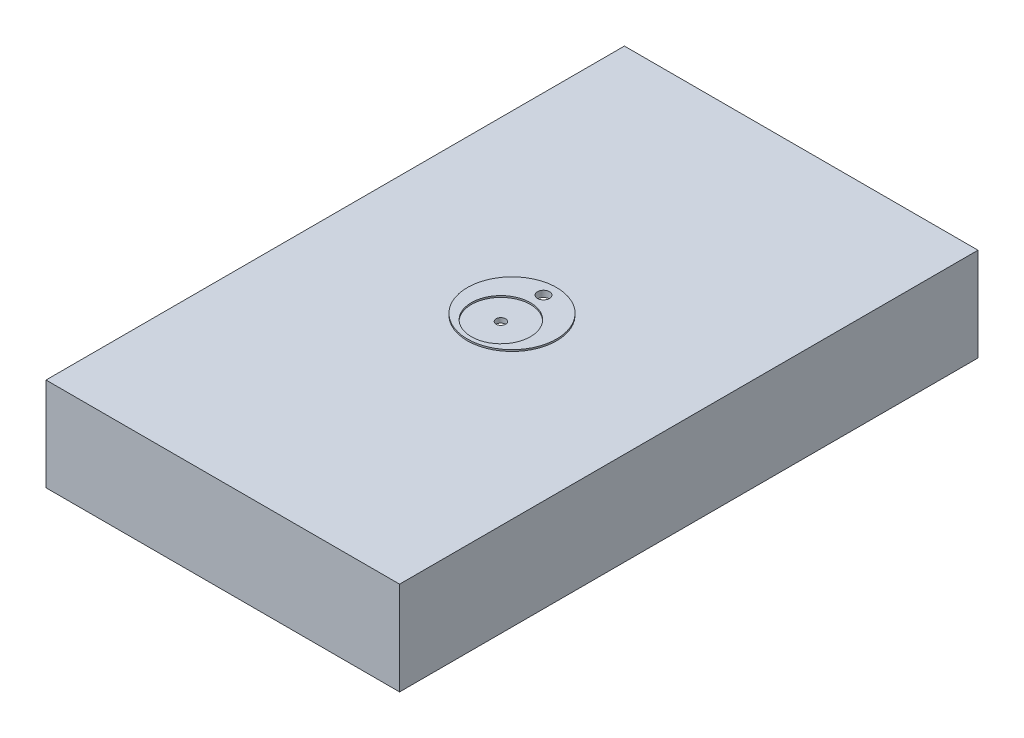
ISO-10303-21;
HEADER;
FILE_DESCRIPTION(('STEP AP214'),'2;1');
FILE_NAME('part.step','',(''),(''),'','','');
FILE_SCHEMA(('AUTOMOTIVE_DESIGN { 1 0 10303 214 1 1 1 1 }'));
ENDSEC;
DATA;
#1=APPLICATION_CONTEXT('core data for automotive mechanical design processes');
#2=APPLICATION_PROTOCOL_DEFINITION('international standard','automotive_design',2000,#1);
#3=PRODUCT_CONTEXT('',#1,'mechanical');
#4=PRODUCT('Part','Part','',(#3));
#5=PRODUCT_RELATED_PRODUCT_CATEGORY('part','',(#4));
#6=PRODUCT_DEFINITION_FORMATION('','',#4);
#7=PRODUCT_DEFINITION_CONTEXT('part definition',#1,'design');
#8=PRODUCT_DEFINITION('design','',#6,#7);
#9=PRODUCT_DEFINITION_SHAPE('','',#8);
#10=(LENGTH_UNIT() NAMED_UNIT(*) SI_UNIT(.MILLI.,.METRE.));
#11=(NAMED_UNIT(*) PLANE_ANGLE_UNIT() SI_UNIT($,.RADIAN.));
#12=(NAMED_UNIT(*) SI_UNIT($,.STERADIAN.) SOLID_ANGLE_UNIT());
#13=UNCERTAINTY_MEASURE_WITH_UNIT(LENGTH_MEASURE(1.E-05),#10,'distance_accuracy_value','');
#14=(GEOMETRIC_REPRESENTATION_CONTEXT(3) GLOBAL_UNCERTAINTY_ASSIGNED_CONTEXT((#13)) GLOBAL_UNIT_ASSIGNED_CONTEXT((#10,
#11,#12)) REPRESENTATION_CONTEXT('',''));
#15=CARTESIAN_POINT('',(0.,0.,0.));
#16=DIRECTION('',(0.,0.,1.));
#17=DIRECTION('',(1.,0.,0.));
#18=AXIS2_PLACEMENT_3D('',#15,#16,#17);
#19=CARTESIAN_POINT('',(0.,1.,0.));
#20=DIRECTION('',(0.,-1.,0.));
#21=DIRECTION('',(0.,0.,-1.));
#22=AXIS2_PLACEMENT_3D('',#19,#20,#21);
#23=CYLINDRICAL_SURFACE('',#22,28.1);
#24=CARTESIAN_POINT('',(0.,1.,0.));
#25=DIRECTION('',(0.,1.,0.));
#26=DIRECTION('',(0.,0.,1.));
#27=AXIS2_PLACEMENT_3D('',#24,#25,#26);
#28=CIRCLE('',#27,28.1);
#29=CARTESIAN_POINT('',(0.,1.,28.1));
#30=VERTEX_POINT('',#29);
#31=EDGE_CURVE('E11',#30,#30,#28,.T.);
#32=ORIENTED_EDGE('',*,*,#31,.F.);
#33=EDGE_LOOP('',(#32));
#34=FACE_BOUND('',#33,.T.);
#35=CARTESIAN_POINT('',(0.,0.,0.));
#36=DIRECTION('',(0.,1.,0.));
#37=DIRECTION('',(0.,0.,1.));
#38=AXIS2_PLACEMENT_3D('',#35,#36,#37);
#39=CIRCLE('',#38,28.1);
#40=CARTESIAN_POINT('',(0.,0.,28.1));
#41=VERTEX_POINT('',#40);
#42=EDGE_CURVE('E179',#41,#41,#39,.T.);
#43=ORIENTED_EDGE('',*,*,#42,.T.);
#44=EDGE_LOOP('',(#43));
#45=FACE_BOUND('',#44,.T.);
#46=ADVANCED_FACE('F38',(#34,#45),#23,.T.);
#47=CARTESIAN_POINT('',(0.,1.,0.));
#48=DIRECTION('',(0.,1.,0.));
#49=DIRECTION('',(0.,0.,1.));
#50=AXIS2_PLACEMENT_3D('',#47,#48,#49);
#51=PLANE('',#50);
#52=CARTESIAN_POINT('',(0.,1.,-19.85));
#53=DIRECTION('',(0.,1.,0.));
#54=DIRECTION('',(0.,0.,1.));
#55=AXIS2_PLACEMENT_3D('',#52,#53,#54);
#56=CIRCLE('',#55,3.75);
#57=CARTESIAN_POINT('',(0.,1.,-16.1));
#58=VERTEX_POINT('',#57);
#59=EDGE_CURVE('E193',#58,#58,#56,.T.);
#60=ORIENTED_EDGE('',*,*,#59,.F.);
#61=EDGE_LOOP('',(#60));
#62=FACE_BOUND('',#61,.T.);
#63=CARTESIAN_POINT('',(0.,1.,7.));
#64=DIRECTION('',(0.,1.,0.));
#65=DIRECTION('',(0.,0.,1.));
#66=AXIS2_PLACEMENT_3D('',#63,#64,#65);
#67=CIRCLE('',#66,18.6);
#68=CARTESIAN_POINT('',(0.,1.,25.6));
#69=VERTEX_POINT('',#68);
#70=EDGE_CURVE('E180',#69,#69,#67,.T.);
#71=ORIENTED_EDGE('',*,*,#70,.F.);
#72=EDGE_LOOP('',(#71));
#73=FACE_BOUND('',#72,.T.);
#74=ORIENTED_EDGE('',*,*,#31,.T.);
#75=EDGE_LOOP('',(#74));
#76=FACE_BOUND('',#75,.T.);
#77=ADVANCED_FACE('F201',(#62,#73,#76),#51,.T.);
#78=CARTESIAN_POINT('',(0.,-57.8,7.));
#79=DIRECTION('',(0.,1.,0.));
#80=DIRECTION('',(0.,0.,1.));
#81=AXIS2_PLACEMENT_3D('',#78,#79,#80);
#82=CYLINDRICAL_SURFACE('',#81,18.6);
#83=ORIENTED_EDGE('',*,*,#70,.T.);
#84=EDGE_LOOP('',(#83));
#85=FACE_BOUND('',#84,.T.);
#86=CARTESIAN_POINT('',(0.,0.,7.));
#87=DIRECTION('',(0.,1.,0.));
#88=DIRECTION('',(0.,0.,1.));
#89=AXIS2_PLACEMENT_3D('',#86,#87,#88);
#90=CIRCLE('',#89,18.6);
#91=CARTESIAN_POINT('',(0.,0.,25.6));
#92=VERTEX_POINT('',#91);
#93=EDGE_CURVE('E46',#92,#92,#90,.T.);
#94=ORIENTED_EDGE('',*,*,#93,.F.);
#95=EDGE_LOOP('',(#94));
#96=FACE_BOUND('',#95,.T.);
#97=ADVANCED_FACE('F204',(#85,#96),#82,.F.);
#98=CARTESIAN_POINT('',(0.,0.,0.));
#99=DIRECTION('',(0.,-1.,0.));
#100=DIRECTION('',(0.,0.,-1.));
#101=AXIS2_PLACEMENT_3D('',#98,#99,#100);
#102=PLANE('',#101);
#103=ORIENTED_EDGE('',*,*,#42,.F.);
#104=EDGE_LOOP('',(#103));
#105=FACE_BOUND('',#104,.T.);
#106=DIRECTION('',(0.,0.,1.));
#107=VECTOR('',#106,1.);
#108=CARTESIAN_POINT('',(111.341546011374,0.,182.141376200391));
#109=LINE('',#108,#107);
#110=CARTESIAN_POINT('',(111.341546011374,0.,-182.141376200391));
#111=VERTEX_POINT('',#110);
#112=CARTESIAN_POINT('',(111.341546011374,0.,182.141376200391));
#113=VERTEX_POINT('',#112);
#114=EDGE_CURVE('E153',#111,#113,#109,.T.);
#115=ORIENTED_EDGE('',*,*,#114,.F.);
#116=DIRECTION('',(1.,0.,0.));
#117=VECTOR('',#116,1.);
#118=CARTESIAN_POINT('',(-111.341546011374,0.,-182.141376200391));
#119=LINE('',#118,#117);
#120=CARTESIAN_POINT('',(-111.341546011374,0.,-182.141376200391));
#121=VERTEX_POINT('',#120);
#122=EDGE_CURVE('E84',#121,#111,#119,.T.);
#123=ORIENTED_EDGE('',*,*,#122,.F.);
#124=DIRECTION('',(0.,0.,-1.));
#125=VECTOR('',#124,1.);
#126=CARTESIAN_POINT('',(-111.341546011374,0.,182.141376200391));
#127=LINE('',#126,#125);
#128=CARTESIAN_POINT('',(-111.341546011374,0.,182.141376200391));
#129=VERTEX_POINT('',#128);
#130=EDGE_CURVE('E168',#129,#121,#127,.T.);
#131=ORIENTED_EDGE('',*,*,#130,.F.);
#132=DIRECTION('',(-1.,0.,0.));
#133=VECTOR('',#132,1.);
#134=CARTESIAN_POINT('',(-111.341546011374,0.,182.141376200391));
#135=LINE('',#134,#133);
#136=EDGE_CURVE('E166',#113,#129,#135,.T.);
#137=ORIENTED_EDGE('',*,*,#136,.F.);
#138=EDGE_LOOP('',(#115,#123,#131,#137));
#139=FACE_BOUND('',#138,.T.);
#140=ADVANCED_FACE('F213',(#105,#139),#102,.F.);
#141=CARTESIAN_POINT('',(0.,-58.8,0.));
#142=DIRECTION('',(0.,-1.,0.));
#143=DIRECTION('',(0.,0.,-1.));
#144=AXIS2_PLACEMENT_3D('',#141,#142,#143);
#145=PLANE('',#144);
#146=DIRECTION('',(0.,0.,1.));
#147=VECTOR('',#146,1.);
#148=CARTESIAN_POINT('',(103.958701758156,-58.8,174.272148859892));
#149=LINE('',#148,#147);
#150=CARTESIAN_POINT('',(103.958701758156,-58.8,-174.272148859892));
#151=VERTEX_POINT('',#150);
#152=CARTESIAN_POINT('',(103.958701758156,-58.8,174.272148859892));
#153=VERTEX_POINT('',#152);
#154=EDGE_CURVE('E54',#151,#153,#149,.T.);
#155=ORIENTED_EDGE('',*,*,#154,.F.);
#156=DIRECTION('',(1.,0.,0.));
#157=VECTOR('',#156,1.);
#158=CARTESIAN_POINT('',(-103.958701758156,-58.8,-174.272148859892));
#159=LINE('',#158,#157);
#160=CARTESIAN_POINT('',(-103.958701758156,-58.8,-174.272148859892));
#161=VERTEX_POINT('',#160);
#162=EDGE_CURVE('E134',#161,#151,#159,.T.);
#163=ORIENTED_EDGE('',*,*,#162,.F.);
#164=DIRECTION('',(0.,0.,-1.));
#165=VECTOR('',#164,1.);
#166=CARTESIAN_POINT('',(-103.958701758156,-58.8,174.272148859892));
#167=LINE('',#166,#165);
#168=CARTESIAN_POINT('',(-103.958701758156,-58.8,174.272148859892));
#169=VERTEX_POINT('',#168);
#170=EDGE_CURVE('E137',#169,#161,#167,.T.);
#171=ORIENTED_EDGE('',*,*,#170,.F.);
#172=DIRECTION('',(-1.,0.,0.));
#173=VECTOR('',#172,1.);
#174=CARTESIAN_POINT('',(-103.958701758156,-58.8,174.272148859892));
#175=LINE('',#174,#173);
#176=EDGE_CURVE('E146',#153,#169,#175,.T.);
#177=ORIENTED_EDGE('',*,*,#176,.F.);
#178=EDGE_LOOP('',(#155,#163,#171,#177));
#179=FACE_BOUND('',#178,.T.);
#180=DIRECTION('',(0.,0.,1.));
#181=VECTOR('',#180,1.);
#182=CARTESIAN_POINT('',(111.341546011374,-58.8,182.141376200391));
#183=LINE('',#182,#181);
#184=CARTESIAN_POINT('',(111.341546011374,-58.8,-182.141376200391));
#185=VERTEX_POINT('',#184);
#186=CARTESIAN_POINT('',(111.341546011374,-58.8,182.141376200391));
#187=VERTEX_POINT('',#186);
#188=EDGE_CURVE('E157',#185,#187,#183,.T.);
#189=ORIENTED_EDGE('',*,*,#188,.T.);
#190=DIRECTION('',(-1.,0.,0.));
#191=VECTOR('',#190,1.);
#192=CARTESIAN_POINT('',(-111.341546011374,-58.8,182.141376200391));
#193=LINE('',#192,#191);
#194=CARTESIAN_POINT('',(-111.341546011374,-58.8,182.141376200391));
#195=VERTEX_POINT('',#194);
#196=EDGE_CURVE('E92',#187,#195,#193,.T.);
#197=ORIENTED_EDGE('',*,*,#196,.T.);
#198=DIRECTION('',(0.,0.,-1.));
#199=VECTOR('',#198,1.);
#200=CARTESIAN_POINT('',(-111.341546011374,-58.8,182.141376200391));
#201=LINE('',#200,#199);
#202=CARTESIAN_POINT('',(-111.341546011374,-58.8,-182.141376200391));
#203=VERTEX_POINT('',#202);
#204=EDGE_CURVE('E160',#195,#203,#201,.T.);
#205=ORIENTED_EDGE('',*,*,#204,.T.);
#206=DIRECTION('',(1.,0.,0.));
#207=VECTOR('',#206,1.);
#208=CARTESIAN_POINT('',(-111.341546011374,-58.8,-182.141376200391));
#209=LINE('',#208,#207);
#210=EDGE_CURVE('E63',#203,#185,#209,.T.);
#211=ORIENTED_EDGE('',*,*,#210,.T.);
#212=EDGE_LOOP('',(#189,#197,#205,#211));
#213=FACE_BOUND('',#212,.T.);
#214=ADVANCED_FACE('F216',(#179,#213),#145,.T.);
#215=CARTESIAN_POINT('',(-111.341546011374,-58.8,-182.141376200391));
#216=DIRECTION('',(0.,0.,1.));
#217=DIRECTION('',(1.,0.,0.));
#218=AXIS2_PLACEMENT_3D('',#215,#216,#217);
#219=PLANE('',#218);
#220=ORIENTED_EDGE('',*,*,#122,.T.);
#221=DIRECTION('',(0.,1.,0.));
#222=VECTOR('',#221,1.);
#223=CARTESIAN_POINT('',(111.341546011374,-58.8,-182.141376200391));
#224=LINE('',#223,#222);
#225=EDGE_CURVE('E163',#185,#111,#224,.T.);
#226=ORIENTED_EDGE('',*,*,#225,.F.);
#227=ORIENTED_EDGE('',*,*,#210,.F.);
#228=DIRECTION('',(0.,1.,0.));
#229=VECTOR('',#228,1.);
#230=CARTESIAN_POINT('',(-111.341546011374,-58.8,-182.141376200391));
#231=LINE('',#230,#229);
#232=EDGE_CURVE('E172',#203,#121,#231,.T.);
#233=ORIENTED_EDGE('',*,*,#232,.T.);
#234=EDGE_LOOP('',(#220,#226,#227,#233));
#235=FACE_BOUND('',#234,.T.);
#236=ADVANCED_FACE('F225',(#235),#219,.F.);
#237=CARTESIAN_POINT('',(-111.341546011374,-58.8,182.141376200391));
#238=DIRECTION('',(1.,0.,0.));
#239=DIRECTION('',(0.,0.,-1.));
#240=AXIS2_PLACEMENT_3D('',#237,#238,#239);
#241=PLANE('',#240);
#242=ORIENTED_EDGE('',*,*,#130,.T.);
#243=ORIENTED_EDGE('',*,*,#232,.F.);
#244=ORIENTED_EDGE('',*,*,#204,.F.);
#245=DIRECTION('',(0.,1.,0.));
#246=VECTOR('',#245,1.);
#247=CARTESIAN_POINT('',(-111.341546011374,-58.8,182.141376200391));
#248=LINE('',#247,#246);
#249=EDGE_CURVE('E174',#195,#129,#248,.T.);
#250=ORIENTED_EDGE('',*,*,#249,.T.);
#251=EDGE_LOOP('',(#242,#243,#244,#250));
#252=FACE_BOUND('',#251,.T.);
#253=ADVANCED_FACE('F229',(#252),#241,.F.);
#254=CARTESIAN_POINT('',(-111.341546011374,-58.8,182.141376200391));
#255=DIRECTION('',(0.,0.,-1.));
#256=DIRECTION('',(-1.,0.,0.));
#257=AXIS2_PLACEMENT_3D('',#254,#255,#256);
#258=PLANE('',#257);
#259=ORIENTED_EDGE('',*,*,#136,.T.);
#260=ORIENTED_EDGE('',*,*,#249,.F.);
#261=ORIENTED_EDGE('',*,*,#196,.F.);
#262=DIRECTION('',(0.,1.,0.));
#263=VECTOR('',#262,1.);
#264=CARTESIAN_POINT('',(111.341546011374,-58.8,182.141376200391));
#265=LINE('',#264,#263);
#266=EDGE_CURVE('E177',#187,#113,#265,.T.);
#267=ORIENTED_EDGE('',*,*,#266,.T.);
#268=EDGE_LOOP('',(#259,#260,#261,#267));
#269=FACE_BOUND('',#268,.T.);
#270=ADVANCED_FACE('F230',(#269),#258,.F.);
#271=CARTESIAN_POINT('',(111.341546011374,-58.8,182.141376200391));
#272=DIRECTION('',(-1.,0.,0.));
#273=DIRECTION('',(0.,0.,1.));
#274=AXIS2_PLACEMENT_3D('',#271,#272,#273);
#275=PLANE('',#274);
#276=ORIENTED_EDGE('',*,*,#114,.T.);
#277=ORIENTED_EDGE('',*,*,#266,.F.);
#278=ORIENTED_EDGE('',*,*,#188,.F.);
#279=ORIENTED_EDGE('',*,*,#225,.T.);
#280=EDGE_LOOP('',(#276,#277,#278,#279));
#281=FACE_BOUND('',#280,.T.);
#282=ADVANCED_FACE('F223',(#281),#275,.F.);
#283=CARTESIAN_POINT('',(0.,0.,7.));
#284=DIRECTION('',(0.,1.,0.));
#285=DIRECTION('',(0.,0.,1.));
#286=AXIS2_PLACEMENT_3D('',#283,#284,#285);
#287=CIRCLE('',#286,3.);
#288=CARTESIAN_POINT('',(0.,0.,10.));
#289=VERTEX_POINT('',#288);
#290=EDGE_CURVE('E140',#289,#289,#287,.T.);
#291=ORIENTED_EDGE('',*,*,#290,.F.);
#292=EDGE_LOOP('',(#291));
#293=FACE_BOUND('',#292,.T.);
#294=ORIENTED_EDGE('',*,*,#93,.T.);
#295=EDGE_LOOP('',(#294));
#296=FACE_BOUND('',#295,.T.);
#297=ADVANCED_FACE('F218',(#293,#296),#102,.F.);
#298=CARTESIAN_POINT('',(103.958701758156,-3.,174.272148859892));
#299=DIRECTION('',(1.,0.,0.));
#300=DIRECTION('',(0.,0.,-1.));
#301=AXIS2_PLACEMENT_3D('',#298,#299,#300);
#302=PLANE('',#301);
#303=ORIENTED_EDGE('',*,*,#154,.T.);
#304=DIRECTION('',(0.,-1.,0.));
#305=VECTOR('',#304,1.);
#306=CARTESIAN_POINT('',(103.958701758156,-3.,174.272148859892));
#307=LINE('',#306,#305);
#308=CARTESIAN_POINT('',(103.958701758156,-3.,174.272148859892));
#309=VERTEX_POINT('',#308);
#310=EDGE_CURVE('E112',#309,#153,#307,.T.);
#311=ORIENTED_EDGE('',*,*,#310,.F.);
#312=DIRECTION('',(0.,0.,1.));
#313=VECTOR('',#312,1.);
#314=CARTESIAN_POINT('',(103.958701758156,-3.,174.272148859892));
#315=LINE('',#314,#313);
#316=CARTESIAN_POINT('',(103.958701758156,-3.,-174.272148859892));
#317=VERTEX_POINT('',#316);
#318=EDGE_CURVE('E116',#317,#309,#315,.T.);
#319=ORIENTED_EDGE('',*,*,#318,.F.);
#320=DIRECTION('',(0.,-1.,0.));
#321=VECTOR('',#320,1.);
#322=CARTESIAN_POINT('',(103.958701758156,-3.,-174.272148859892));
#323=LINE('',#322,#321);
#324=EDGE_CURVE('E151',#317,#151,#323,.T.);
#325=ORIENTED_EDGE('',*,*,#324,.T.);
#326=EDGE_LOOP('',(#303,#311,#319,#325));
#327=FACE_BOUND('',#326,.T.);
#328=ADVANCED_FACE('F114',(#327),#302,.F.);
#329=CARTESIAN_POINT('',(-103.958701758156,-3.,-174.272148859892));
#330=DIRECTION('',(0.,0.,-1.));
#331=DIRECTION('',(-1.,0.,0.));
#332=AXIS2_PLACEMENT_3D('',#329,#330,#331);
#333=PLANE('',#332);
#334=ORIENTED_EDGE('',*,*,#162,.T.);
#335=ORIENTED_EDGE('',*,*,#324,.F.);
#336=DIRECTION('',(1.,0.,0.));
#337=VECTOR('',#336,1.);
#338=CARTESIAN_POINT('',(-103.958701758156,-3.,-174.272148859892));
#339=LINE('',#338,#337);
#340=CARTESIAN_POINT('',(-103.958701758156,-3.,-174.272148859892));
#341=VERTEX_POINT('',#340);
#342=EDGE_CURVE('E122',#341,#317,#339,.T.);
#343=ORIENTED_EDGE('',*,*,#342,.F.);
#344=DIRECTION('',(0.,-1.,0.));
#345=VECTOR('',#344,1.);
#346=CARTESIAN_POINT('',(-103.958701758156,-3.,-174.272148859892));
#347=LINE('',#346,#345);
#348=EDGE_CURVE('E154',#341,#161,#347,.T.);
#349=ORIENTED_EDGE('',*,*,#348,.T.);
#350=EDGE_LOOP('',(#334,#335,#343,#349));
#351=FACE_BOUND('',#350,.T.);
#352=ADVANCED_FACE('F253',(#351),#333,.F.);
#353=CARTESIAN_POINT('',(-103.958701758156,-3.,174.272148859892));
#354=DIRECTION('',(-1.,0.,0.));
#355=DIRECTION('',(0.,0.,1.));
#356=AXIS2_PLACEMENT_3D('',#353,#354,#355);
#357=PLANE('',#356);
#358=ORIENTED_EDGE('',*,*,#170,.T.);
#359=ORIENTED_EDGE('',*,*,#348,.F.);
#360=DIRECTION('',(0.,0.,-1.));
#361=VECTOR('',#360,1.);
#362=CARTESIAN_POINT('',(-103.958701758156,-3.,174.272148859892));
#363=LINE('',#362,#361);
#364=CARTESIAN_POINT('',(-103.958701758156,-3.,174.272148859892));
#365=VERTEX_POINT('',#364);
#366=EDGE_CURVE('E130',#365,#341,#363,.T.);
#367=ORIENTED_EDGE('',*,*,#366,.F.);
#368=DIRECTION('',(0.,-1.,0.));
#369=VECTOR('',#368,1.);
#370=CARTESIAN_POINT('',(-103.958701758156,-3.,174.272148859892));
#371=LINE('',#370,#369);
#372=EDGE_CURVE('E121',#365,#169,#371,.T.);
#373=ORIENTED_EDGE('',*,*,#372,.T.);
#374=EDGE_LOOP('',(#358,#359,#367,#373));
#375=FACE_BOUND('',#374,.T.);
#376=ADVANCED_FACE('F266',(#375),#357,.F.);
#377=CARTESIAN_POINT('',(-103.958701758156,-3.,174.272148859892));
#378=DIRECTION('',(0.,0.,1.));
#379=DIRECTION('',(1.,0.,0.));
#380=AXIS2_PLACEMENT_3D('',#377,#378,#379);
#381=PLANE('',#380);
#382=ORIENTED_EDGE('',*,*,#176,.T.);
#383=ORIENTED_EDGE('',*,*,#372,.F.);
#384=DIRECTION('',(-1.,0.,0.));
#385=VECTOR('',#384,1.);
#386=CARTESIAN_POINT('',(-103.958701758156,-3.,174.272148859892));
#387=LINE('',#386,#385);
#388=EDGE_CURVE('E125',#309,#365,#387,.T.);
#389=ORIENTED_EDGE('',*,*,#388,.F.);
#390=ORIENTED_EDGE('',*,*,#310,.T.);
#391=EDGE_LOOP('',(#382,#383,#389,#390));
#392=FACE_BOUND('',#391,.T.);
#393=ADVANCED_FACE('F126',(#392),#381,.F.);
#394=CARTESIAN_POINT('',(0.,-3.,0.));
#395=DIRECTION('',(0.,-1.,0.));
#396=DIRECTION('',(0.,0.,-1.));
#397=AXIS2_PLACEMENT_3D('',#394,#395,#396);
#398=PLANE('',#397);
#399=CARTESIAN_POINT('',(0.,-3.,-19.85));
#400=DIRECTION('',(0.,-1.,0.));
#401=DIRECTION('',(0.,0.,-1.));
#402=AXIS2_PLACEMENT_3D('',#399,#400,#401);
#403=CIRCLE('',#402,3.75);
#404=CARTESIAN_POINT('',(0.,-3.,-23.6));
#405=VERTEX_POINT('',#404);
#406=EDGE_CURVE('E41',#405,#405,#403,.T.);
#407=ORIENTED_EDGE('',*,*,#406,.F.);
#408=EDGE_LOOP('',(#407));
#409=FACE_BOUND('',#408,.T.);
#410=CARTESIAN_POINT('',(0.,-3.,7.));
#411=DIRECTION('',(0.,-1.,0.));
#412=DIRECTION('',(0.,0.,-1.));
#413=AXIS2_PLACEMENT_3D('',#410,#411,#412);
#414=CIRCLE('',#413,3.);
#415=CARTESIAN_POINT('',(0.,-3.,4.));
#416=VERTEX_POINT('',#415);
#417=EDGE_CURVE('E147',#416,#416,#414,.T.);
#418=ORIENTED_EDGE('',*,*,#417,.F.);
#419=EDGE_LOOP('',(#418));
#420=FACE_BOUND('',#419,.T.);
#421=ORIENTED_EDGE('',*,*,#318,.T.);
#422=ORIENTED_EDGE('',*,*,#388,.T.);
#423=ORIENTED_EDGE('',*,*,#366,.T.);
#424=ORIENTED_EDGE('',*,*,#342,.T.);
#425=EDGE_LOOP('',(#421,#422,#423,#424));
#426=FACE_BOUND('',#425,.T.);
#427=ADVANCED_FACE('F132',(#409,#420,#426),#398,.T.);
#428=CARTESIAN_POINT('',(0.,-10.,7.));
#429=DIRECTION('',(0.,1.,0.));
#430=DIRECTION('',(0.,0.,1.));
#431=AXIS2_PLACEMENT_3D('',#428,#429,#430);
#432=CYLINDRICAL_SURFACE('',#431,3.);
#433=ORIENTED_EDGE('',*,*,#417,.T.);
#434=EDGE_LOOP('',(#433));
#435=FACE_BOUND('',#434,.T.);
#436=ORIENTED_EDGE('',*,*,#290,.T.);
#437=EDGE_LOOP('',(#436));
#438=FACE_BOUND('',#437,.T.);
#439=ADVANCED_FACE('F281',(#435,#438),#432,.F.);
#440=CARTESIAN_POINT('',(0.,-9.,-19.85));
#441=DIRECTION('',(0.,1.,0.));
#442=DIRECTION('',(0.,0.,1.));
#443=AXIS2_PLACEMENT_3D('',#440,#441,#442);
#444=CYLINDRICAL_SURFACE('',#443,3.75);
#445=ORIENTED_EDGE('',*,*,#406,.T.);
#446=EDGE_LOOP('',(#445));
#447=FACE_BOUND('',#446,.T.);
#448=ORIENTED_EDGE('',*,*,#59,.T.);
#449=EDGE_LOOP('',(#448));
#450=FACE_BOUND('',#449,.T.);
#451=ADVANCED_FACE('F199',(#447,#450),#444,.F.);
#452=CLOSED_SHELL('',(#46,#77,#97,#140,#214,#236,#253,#270,#282,#297,#328,#352,#376,#393,#427,
#439,#451));
#453=MANIFOLD_SOLID_BREP('B2',#452);
#454=ADVANCED_BREP_SHAPE_REPRESENTATION('',(#18,#453),#14);
#455=SHAPE_DEFINITION_REPRESENTATION(#9,#454);
ENDSEC;
END-ISO-10303-21;
